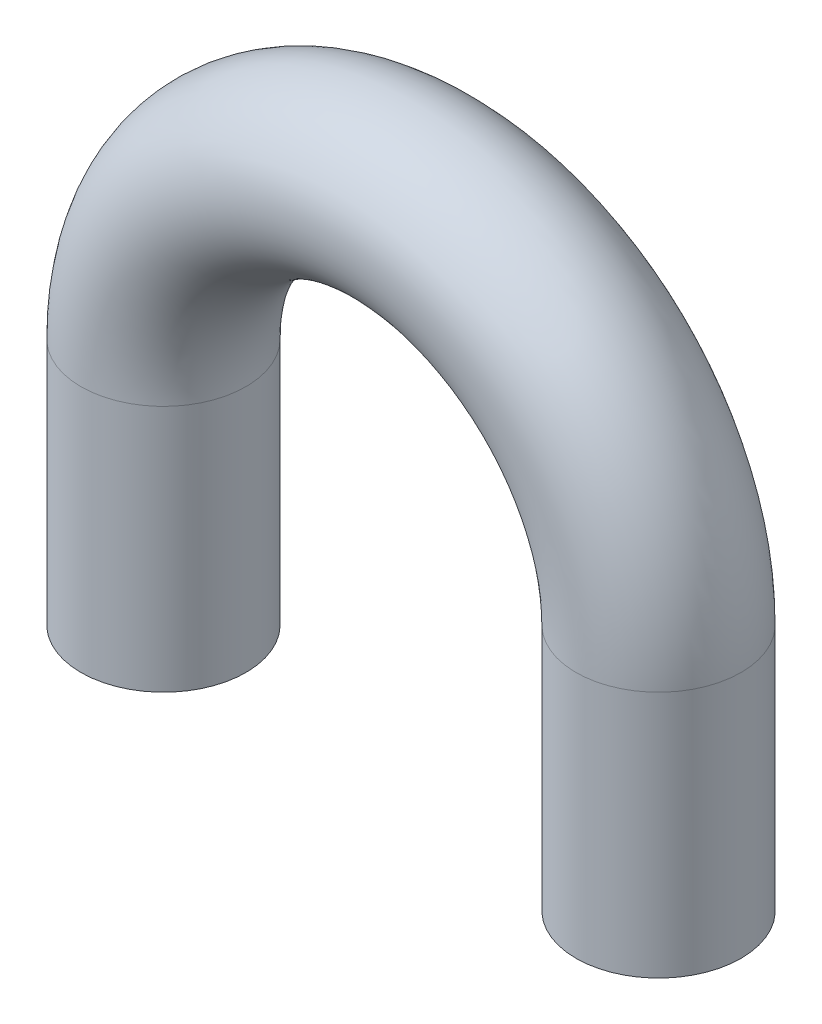
ISO-10303-21;
HEADER;
FILE_DESCRIPTION(('STEP AP214'),'2;1');
FILE_NAME('part.step','',(''),(''),'','','');
FILE_SCHEMA(('AUTOMOTIVE_DESIGN { 1 0 10303 214 1 1 1 1 }'));
ENDSEC;
DATA;
#1=APPLICATION_CONTEXT('core data for automotive mechanical design processes');
#2=APPLICATION_PROTOCOL_DEFINITION('international standard','automotive_design',2000,#1);
#3=PRODUCT_CONTEXT('',#1,'mechanical');
#4=PRODUCT('Part','Part','',(#3));
#5=PRODUCT_RELATED_PRODUCT_CATEGORY('part','',(#4));
#6=PRODUCT_DEFINITION_FORMATION('','',#4);
#7=PRODUCT_DEFINITION_CONTEXT('part definition',#1,'design');
#8=PRODUCT_DEFINITION('design','',#6,#7);
#9=PRODUCT_DEFINITION_SHAPE('','',#8);
#10=(LENGTH_UNIT() NAMED_UNIT(*) SI_UNIT(.MILLI.,.METRE.));
#11=(NAMED_UNIT(*) PLANE_ANGLE_UNIT() SI_UNIT($,.RADIAN.));
#12=(NAMED_UNIT(*) SI_UNIT($,.STERADIAN.) SOLID_ANGLE_UNIT());
#13=UNCERTAINTY_MEASURE_WITH_UNIT(LENGTH_MEASURE(1.E-05),#10,'distance_accuracy_value','');
#14=(GEOMETRIC_REPRESENTATION_CONTEXT(3) GLOBAL_UNCERTAINTY_ASSIGNED_CONTEXT((#13)) GLOBAL_UNIT_ASSIGNED_CONTEXT((#10,
#11,#12)) REPRESENTATION_CONTEXT('',''));
#15=CARTESIAN_POINT('',(0.,0.,0.));
#16=DIRECTION('',(0.,0.,1.));
#17=DIRECTION('',(1.,0.,0.));
#18=AXIS2_PLACEMENT_3D('',#15,#16,#17);
#19=CARTESIAN_POINT('',(-3.,3.,0.));
#20=DIRECTION('',(0.,-1.,0.));
#21=DIRECTION('',(1.,0.,0.));
#22=AXIS2_PLACEMENT_3D('',#19,#20,#21);
#23=CYLINDRICAL_SURFACE('',#22,1.);
#24=CARTESIAN_POINT('',(-3.,3.,0.));
#25=DIRECTION('',(0.,-1.,0.));
#26=DIRECTION('',(0.,0.,1.));
#27=AXIS2_PLACEMENT_3D('',#24,#25,#26);
#28=CIRCLE('',#27,1.);
#29=CARTESIAN_POINT('',(-4.,3.,0.));
#30=VERTEX_POINT('',#29);
#31=EDGE_CURVE('E36',#30,#30,#28,.T.);
#32=ORIENTED_EDGE('',*,*,#31,.T.);
#33=EDGE_LOOP('',(#32));
#34=FACE_BOUND('',#33,.T.);
#35=CARTESIAN_POINT('',(-3.,0.,0.));
#36=DIRECTION('',(0.,-1.,0.));
#37=DIRECTION('',(0.,0.,1.));
#38=AXIS2_PLACEMENT_3D('',#35,#36,#37);
#39=CIRCLE('',#38,1.);
#40=CARTESIAN_POINT('',(-3.,0.,1.));
#41=VERTEX_POINT('',#40);
#42=EDGE_CURVE('E10',#41,#41,#39,.T.);
#43=ORIENTED_EDGE('',*,*,#42,.F.);
#44=EDGE_LOOP('',(#43));
#45=FACE_BOUND('',#44,.T.);
#46=ADVANCED_FACE('F30',(#34,#45),#23,.T.);
#47=CARTESIAN_POINT('',(0.,3.,0.));
#48=DIRECTION('',(0.,0.,1.));
#49=DIRECTION('',(1.,0.,0.));
#50=AXIS2_PLACEMENT_3D('',#47,#48,#49);
#51=TOROIDAL_SURFACE('',#50,3.,1.);
#52=CARTESIAN_POINT('',(3.,3.,0.));
#53=DIRECTION('',(0.,1.,0.));
#54=DIRECTION('',(0.,0.,1.));
#55=AXIS2_PLACEMENT_3D('',#52,#53,#54);
#56=CIRCLE('',#55,1.);
#57=CARTESIAN_POINT('',(4.,3.,0.));
#58=VERTEX_POINT('',#57);
#59=EDGE_CURVE('E40',#58,#58,#56,.T.);
#60=CARTESIAN_POINT('',(0.,3.,0.));
#61=DIRECTION('',(0.,0.,1.));
#62=DIRECTION('',(1.,0.,0.));
#63=AXIS2_PLACEMENT_3D('',#60,#61,#62);
#64=CIRCLE('',#63,4.);
#65=EDGE_CURVE('',#58,#30,#64,.T.);
#66=ORIENTED_EDGE('',*,*,#59,.T.);
#67=ORIENTED_EDGE('',*,*,#31,.F.);
#68=ORIENTED_EDGE('',*,*,#65,.T.);
#69=ORIENTED_EDGE('',*,*,#65,.F.);
#70=EDGE_LOOP('',(#66,#68,#67,#69));
#71=FACE_BOUND('',#70,.T.);
#72=ADVANCED_FACE('F62',(#71),#51,.T.);
#73=CARTESIAN_POINT('',(3.,3.,0.));
#74=DIRECTION('',(0.,-1.,0.));
#75=DIRECTION('',(1.,0.,0.));
#76=AXIS2_PLACEMENT_3D('',#73,#74,#75);
#77=CYLINDRICAL_SURFACE('',#76,1.);
#78=ORIENTED_EDGE('',*,*,#59,.F.);
#79=EDGE_LOOP('',(#78));
#80=FACE_BOUND('',#79,.T.);
#81=CARTESIAN_POINT('',(3.,0.,0.));
#82=DIRECTION('',(0.,1.,0.));
#83=DIRECTION('',(0.,0.,1.));
#84=AXIS2_PLACEMENT_3D('',#81,#82,#83);
#85=CIRCLE('',#84,1.);
#86=CARTESIAN_POINT('',(3.,0.,1.));
#87=VERTEX_POINT('',#86);
#88=EDGE_CURVE('E44',#87,#87,#85,.T.);
#89=ORIENTED_EDGE('',*,*,#88,.T.);
#90=EDGE_LOOP('',(#89));
#91=FACE_BOUND('',#90,.T.);
#92=ADVANCED_FACE('F50',(#80,#91),#77,.T.);
#93=CARTESIAN_POINT('',(-3.,0.,0.));
#94=DIRECTION('',(0.,-1.,0.));
#95=DIRECTION('',(0.,0.,1.));
#96=AXIS2_PLACEMENT_3D('',#93,#94,#95);
#97=PLANE('',#96);
#98=ORIENTED_EDGE('',*,*,#42,.T.);
#99=EDGE_LOOP('',(#98));
#100=FACE_BOUND('',#99,.T.);
#101=ADVANCED_FACE('F54',(#100),#97,.T.);
#102=CARTESIAN_POINT('',(3.,0.,0.));
#103=DIRECTION('',(0.,1.,0.));
#104=DIRECTION('',(0.,0.,1.));
#105=AXIS2_PLACEMENT_3D('',#102,#103,#104);
#106=PLANE('',#105);
#107=ORIENTED_EDGE('',*,*,#88,.F.);
#108=EDGE_LOOP('',(#107));
#109=FACE_BOUND('',#108,.T.);
#110=ADVANCED_FACE('F52',(#109),#106,.F.);
#111=CLOSED_SHELL('',(#46,#72,#92,#101,#110));
#112=MANIFOLD_SOLID_BREP('B2',#111);
#113=ADVANCED_BREP_SHAPE_REPRESENTATION('',(#18,#112),#14);
#114=SHAPE_DEFINITION_REPRESENTATION(#9,#113);
ENDSEC;
END-ISO-10303-21;
